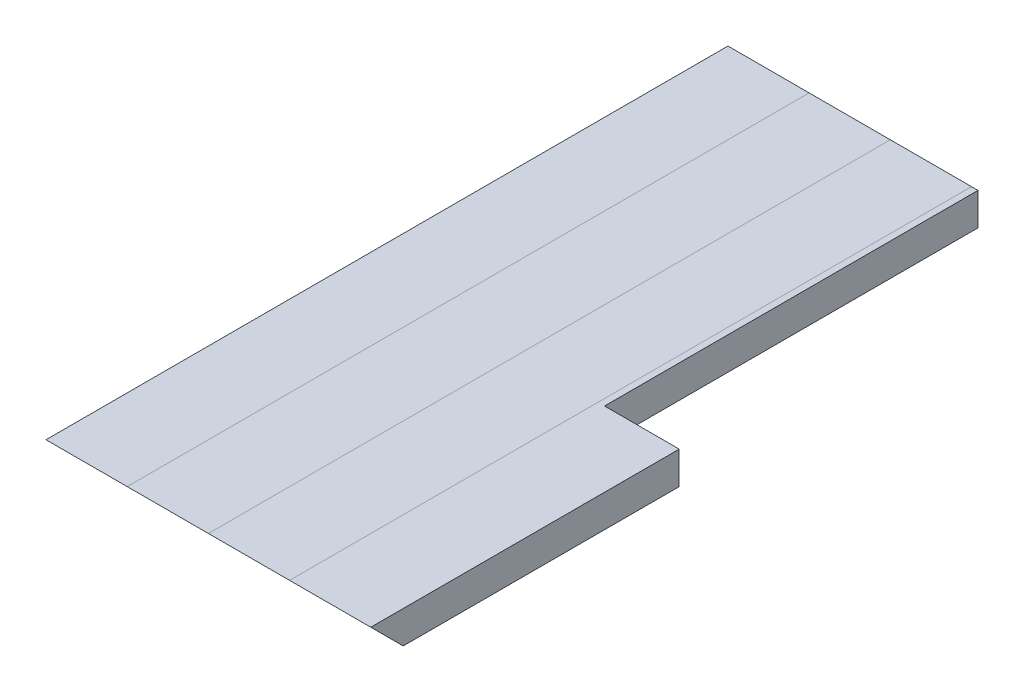
ISO-10303-21;
HEADER;
FILE_DESCRIPTION(('STEP AP214'),'2;1');
FILE_NAME('part.step','',(''),(''),'','','');
FILE_SCHEMA(('AUTOMOTIVE_DESIGN { 1 0 10303 214 1 1 1 1 }'));
ENDSEC;
DATA;
#1=APPLICATION_CONTEXT('core data for automotive mechanical design processes');
#2=APPLICATION_PROTOCOL_DEFINITION('international standard','automotive_design',2000,#1);
#3=PRODUCT_CONTEXT('',#1,'mechanical');
#4=PRODUCT('Part','Part','',(#3));
#5=PRODUCT_RELATED_PRODUCT_CATEGORY('part','',(#4));
#6=PRODUCT_DEFINITION_FORMATION('','',#4);
#7=PRODUCT_DEFINITION_CONTEXT('part definition',#1,'design');
#8=PRODUCT_DEFINITION('design','',#6,#7);
#9=PRODUCT_DEFINITION_SHAPE('','',#8);
#10=(LENGTH_UNIT() NAMED_UNIT(*) SI_UNIT(.MILLI.,.METRE.));
#11=(NAMED_UNIT(*) PLANE_ANGLE_UNIT() SI_UNIT($,.RADIAN.));
#12=(NAMED_UNIT(*) SI_UNIT($,.STERADIAN.) SOLID_ANGLE_UNIT());
#13=UNCERTAINTY_MEASURE_WITH_UNIT(LENGTH_MEASURE(1.E-05),#10,'distance_accuracy_value','');
#14=(GEOMETRIC_REPRESENTATION_CONTEXT(3) GLOBAL_UNCERTAINTY_ASSIGNED_CONTEXT((#13)) GLOBAL_UNIT_ASSIGNED_CONTEXT((#10,
#11,#12)) REPRESENTATION_CONTEXT('',''));
#15=CARTESIAN_POINT('',(0.,0.,0.));
#16=DIRECTION('',(0.,0.,1.));
#17=DIRECTION('',(1.,0.,0.));
#18=AXIS2_PLACEMENT_3D('',#15,#16,#17);
#19=CARTESIAN_POINT('',(0.,0.,0.));
#20=DIRECTION('',(0.,1.,0.));
#21=DIRECTION('',(0.,0.,1.));
#22=AXIS2_PLACEMENT_3D('',#19,#20,#21);
#23=PLANE('',#22);
#24=DIRECTION('',(0.,0.,1.));
#25=VECTOR('',#24,1.);
#26=CARTESIAN_POINT('',(-12.5,0.,-105.));
#27=LINE('',#26,#25);
#28=CARTESIAN_POINT('',(-12.5,0.,-105.));
#29=VERTEX_POINT('',#28);
#30=CARTESIAN_POINT('',(-12.5,0.,95.));
#31=VERTEX_POINT('',#30);
#32=EDGE_CURVE('P0_E81',#29,#31,#27,.T.);
#33=ORIENTED_EDGE('',*,*,#32,.F.);
#34=DIRECTION('',(-1.,0.,0.));
#35=VECTOR('',#34,1.);
#36=CARTESIAN_POINT('',(12.5,0.,-105.));
#37=LINE('',#36,#35);
#38=CARTESIAN_POINT('',(12.5,0.,-105.));
#39=VERTEX_POINT('',#38);
#40=EDGE_CURVE('P0_E55',#39,#29,#37,.T.);
#41=ORIENTED_EDGE('',*,*,#40,.F.);
#42=DIRECTION('',(0.,0.,-1.));
#43=VECTOR('',#42,1.);
#44=CARTESIAN_POINT('',(12.5,0.,105.));
#45=LINE('',#44,#43);
#46=CARTESIAN_POINT('',(12.5,0.,95.));
#47=VERTEX_POINT('',#46);
#48=EDGE_CURVE('P0_E67',#47,#39,#45,.T.);
#49=ORIENTED_EDGE('',*,*,#48,.F.);
#50=DIRECTION('',(1.,0.,0.));
#51=VECTOR('',#50,1.);
#52=CARTESIAN_POINT('',(-12.5,0.,95.));
#53=LINE('',#52,#51);
#54=EDGE_CURVE('P0_E20',#47,#31,#53,.F.);
#55=ORIENTED_EDGE('',*,*,#54,.T.);
#56=EDGE_LOOP('',(#33,#41,#49,#55));
#57=FACE_BOUND('',#56,.T.);
#58=ADVANCED_FACE('P0_F17',(#57),#23,.F.);
#59=CARTESIAN_POINT('',(-12.5,0.,95.));
#60=DIRECTION('',(0.,0.707106781186548,-0.707106781186548));
#61=DIRECTION('',(0.,0.707106781186548,0.707106781186548));
#62=AXIS2_PLACEMENT_3D('',#59,#60,#61);
#63=PLANE('',#62);
#64=DIRECTION('',(1.,0.,0.));
#65=VECTOR('',#64,1.);
#66=CARTESIAN_POINT('',(0.,10.,105.));
#67=LINE('',#66,#65);
#68=CARTESIAN_POINT('',(-12.5,9.99999999999999,105.));
#69=VERTEX_POINT('',#68);
#70=CARTESIAN_POINT('',(12.5,10.,105.));
#71=VERTEX_POINT('',#70);
#72=EDGE_CURVE('P0_E83',#69,#71,#67,.T.);
#73=ORIENTED_EDGE('',*,*,#72,.F.);
#74=DIRECTION('',(0.,0.707106781186548,0.707106781186547));
#75=VECTOR('',#74,1.);
#76=CARTESIAN_POINT('',(-12.5,0.,95.));
#77=LINE('',#76,#75);
#78=EDGE_CURVE('P0_E65',#31,#69,#77,.T.);
#79=ORIENTED_EDGE('',*,*,#78,.F.);
#80=ORIENTED_EDGE('',*,*,#54,.F.);
#81=DIRECTION('',(0.,-0.707106781186548,-0.707106781186547));
#82=VECTOR('',#81,1.);
#83=CARTESIAN_POINT('',(12.5,10.,105.));
#84=LINE('',#83,#82);
#85=EDGE_CURVE('P0_E62',#71,#47,#84,.T.);
#86=ORIENTED_EDGE('',*,*,#85,.F.);
#87=EDGE_LOOP('',(#73,#79,#80,#86));
#88=FACE_BOUND('',#87,.T.);
#89=ADVANCED_FACE('P0_F60',(#88),#63,.F.);
#90=CARTESIAN_POINT('',(12.5,0.,105.));
#91=DIRECTION('',(1.,0.,0.));
#92=DIRECTION('',(0.,0.,-1.));
#93=AXIS2_PLACEMENT_3D('',#90,#91,#92);
#94=PLANE('',#93);
#95=DIRECTION('',(0.,1.,0.));
#96=VECTOR('',#95,1.);
#97=CARTESIAN_POINT('',(12.5,0.,-105.));
#98=LINE('',#97,#96);
#99=CARTESIAN_POINT('',(12.5,10.,-105.));
#100=VERTEX_POINT('',#99);
#101=EDGE_CURVE('P0_E77',#100,#39,#98,.F.);
#102=ORIENTED_EDGE('',*,*,#101,.F.);
#103=DIRECTION('',(0.,0.,1.));
#104=VECTOR('',#103,1.);
#105=CARTESIAN_POINT('',(12.5,10.,0.));
#106=LINE('',#105,#104);
#107=EDGE_CURVE('P0_E73',#71,#100,#106,.F.);
#108=ORIENTED_EDGE('',*,*,#107,.F.);
#109=ORIENTED_EDGE('',*,*,#85,.T.);
#110=ORIENTED_EDGE('',*,*,#48,.T.);
#111=EDGE_LOOP('',(#102,#108,#109,#110));
#112=FACE_BOUND('',#111,.T.);
#113=ADVANCED_FACE('P0_F71',(#112),#94,.T.);
#114=CARTESIAN_POINT('',(12.5,0.,-105.));
#115=DIRECTION('',(0.,0.,-1.));
#116=DIRECTION('',(-1.,0.,0.));
#117=AXIS2_PLACEMENT_3D('',#114,#115,#116);
#118=PLANE('',#117);
#119=DIRECTION('',(1.,0.,0.));
#120=VECTOR('',#119,1.);
#121=CARTESIAN_POINT('',(0.,10.,-105.));
#122=LINE('',#121,#120);
#123=CARTESIAN_POINT('',(-12.5,10.,-105.));
#124=VERTEX_POINT('',#123);
#125=EDGE_CURVE('P0_E26',#100,#124,#122,.F.);
#126=ORIENTED_EDGE('',*,*,#125,.F.);
#127=ORIENTED_EDGE('',*,*,#101,.T.);
#128=ORIENTED_EDGE('',*,*,#40,.T.);
#129=DIRECTION('',(0.,1.,0.));
#130=VECTOR('',#129,1.);
#131=CARTESIAN_POINT('',(-12.5,0.,-105.));
#132=LINE('',#131,#130);
#133=EDGE_CURVE('P0_E35',#124,#29,#132,.F.);
#134=ORIENTED_EDGE('',*,*,#133,.F.);
#135=EDGE_LOOP('',(#126,#127,#128,#134));
#136=FACE_BOUND('',#135,.T.);
#137=ADVANCED_FACE('P0_F89',(#136),#118,.T.);
#138=CARTESIAN_POINT('',(-12.5,0.,-105.));
#139=DIRECTION('',(-1.,0.,0.));
#140=DIRECTION('',(0.,0.,1.));
#141=AXIS2_PLACEMENT_3D('',#138,#139,#140);
#142=PLANE('',#141);
#143=ORIENTED_EDGE('',*,*,#133,.T.);
#144=ORIENTED_EDGE('',*,*,#32,.T.);
#145=ORIENTED_EDGE('',*,*,#78,.T.);
#146=DIRECTION('',(0.,0.,1.));
#147=VECTOR('',#146,1.);
#148=CARTESIAN_POINT('',(-12.5,10.,0.));
#149=LINE('',#148,#147);
#150=EDGE_CURVE('P0_E11',#124,#69,#149,.T.);
#151=ORIENTED_EDGE('',*,*,#150,.F.);
#152=EDGE_LOOP('',(#143,#144,#145,#151));
#153=FACE_BOUND('',#152,.T.);
#154=ADVANCED_FACE('P0_F91',(#153),#142,.T.);
#155=CARTESIAN_POINT('',(0.,10.,0.));
#156=DIRECTION('',(0.,1.,0.));
#157=DIRECTION('',(0.,0.,1.));
#158=AXIS2_PLACEMENT_3D('',#155,#156,#157);
#159=PLANE('',#158);
#160=ORIENTED_EDGE('',*,*,#125,.T.);
#161=ORIENTED_EDGE('',*,*,#150,.T.);
#162=ORIENTED_EDGE('',*,*,#72,.T.);
#163=ORIENTED_EDGE('',*,*,#107,.T.);
#164=EDGE_LOOP('',(#160,#161,#162,#163));
#165=FACE_BOUND('',#164,.T.);
#166=ADVANCED_FACE('P0_F88',(#165),#159,.T.);
#167=CLOSED_SHELL('',(#58,#89,#113,#137,#154,#166));
#168=MANIFOLD_SOLID_BREP('P0_B1',#167);
#169=CARTESIAN_POINT('',(25.,0.,0.));
#170=DIRECTION('',(0.,1.,0.));
#171=DIRECTION('',(0.,0.,1.));
#172=AXIS2_PLACEMENT_3D('',#169,#170,#171);
#173=PLANE('',#172);
#174=DIRECTION('',(0.,0.,1.));
#175=VECTOR('',#174,1.);
#176=CARTESIAN_POINT('',(12.5,0.,-105.));
#177=LINE('',#176,#175);
#178=CARTESIAN_POINT('',(12.5,0.,-105.));
#179=VERTEX_POINT('',#178);
#180=CARTESIAN_POINT('',(12.5,0.,95.));
#181=VERTEX_POINT('',#180);
#182=EDGE_CURVE('P1_E81',#179,#181,#177,.T.);
#183=ORIENTED_EDGE('',*,*,#182,.F.);
#184=DIRECTION('',(-1.,0.,0.));
#185=VECTOR('',#184,1.);
#186=CARTESIAN_POINT('',(37.5,0.,-105.));
#187=LINE('',#186,#185);
#188=CARTESIAN_POINT('',(37.5,0.,-105.));
#189=VERTEX_POINT('',#188);
#190=EDGE_CURVE('P1_E55',#189,#179,#187,.T.);
#191=ORIENTED_EDGE('',*,*,#190,.F.);
#192=DIRECTION('',(0.,0.,-1.));
#193=VECTOR('',#192,1.);
#194=CARTESIAN_POINT('',(37.5,0.,105.));
#195=LINE('',#194,#193);
#196=CARTESIAN_POINT('',(37.5,0.,95.));
#197=VERTEX_POINT('',#196);
#198=EDGE_CURVE('P1_E67',#197,#189,#195,.T.);
#199=ORIENTED_EDGE('',*,*,#198,.F.);
#200=DIRECTION('',(1.,0.,0.));
#201=VECTOR('',#200,1.);
#202=CARTESIAN_POINT('',(-12.5,0.,95.));
#203=LINE('',#202,#201);
#204=EDGE_CURVE('P1_E20',#197,#181,#203,.F.);
#205=ORIENTED_EDGE('',*,*,#204,.T.);
#206=EDGE_LOOP('',(#183,#191,#199,#205));
#207=FACE_BOUND('',#206,.T.);
#208=ADVANCED_FACE('P1_F17',(#207),#173,.F.);
#209=CARTESIAN_POINT('',(-12.5,0.,95.));
#210=DIRECTION('',(0.,0.707106781186548,-0.707106781186548));
#211=DIRECTION('',(0.,0.707106781186548,0.707106781186548));
#212=AXIS2_PLACEMENT_3D('',#209,#210,#211);
#213=PLANE('',#212);
#214=ORIENTED_EDGE('',*,*,#204,.F.);
#215=DIRECTION('',(0.,-0.707106781186548,-0.707106781186547));
#216=VECTOR('',#215,1.);
#217=CARTESIAN_POINT('',(37.5,10.,105.));
#218=LINE('',#217,#216);
#219=CARTESIAN_POINT('',(37.5,10.,105.));
#220=VERTEX_POINT('',#219);
#221=EDGE_CURVE('P1_E62',#220,#197,#218,.T.);
#222=ORIENTED_EDGE('',*,*,#221,.F.);
#223=DIRECTION('',(1.,0.,0.));
#224=VECTOR('',#223,1.);
#225=CARTESIAN_POINT('',(25.,10.,105.));
#226=LINE('',#225,#224);
#227=CARTESIAN_POINT('',(12.5,10.,105.));
#228=VERTEX_POINT('',#227);
#229=EDGE_CURVE('P1_E83',#228,#220,#226,.T.);
#230=ORIENTED_EDGE('',*,*,#229,.F.);
#231=DIRECTION('',(0.,0.707106781186548,0.707106781186547));
#232=VECTOR('',#231,1.);
#233=CARTESIAN_POINT('',(12.5,0.,95.));
#234=LINE('',#233,#232);
#235=EDGE_CURVE('P1_E65',#181,#228,#234,.T.);
#236=ORIENTED_EDGE('',*,*,#235,.F.);
#237=EDGE_LOOP('',(#214,#222,#230,#236));
#238=FACE_BOUND('',#237,.T.);
#239=ADVANCED_FACE('P1_F60',(#238),#213,.F.);
#240=CARTESIAN_POINT('',(37.5,0.,105.));
#241=DIRECTION('',(1.,0.,0.));
#242=DIRECTION('',(0.,0.,-1.));
#243=AXIS2_PLACEMENT_3D('',#240,#241,#242);
#244=PLANE('',#243);
#245=DIRECTION('',(0.,1.,0.));
#246=VECTOR('',#245,1.);
#247=CARTESIAN_POINT('',(37.5,0.,-105.));
#248=LINE('',#247,#246);
#249=CARTESIAN_POINT('',(37.5,10.,-105.));
#250=VERTEX_POINT('',#249);
#251=EDGE_CURVE('P1_E77',#250,#189,#248,.F.);
#252=ORIENTED_EDGE('',*,*,#251,.F.);
#253=DIRECTION('',(0.,0.,1.));
#254=VECTOR('',#253,1.);
#255=CARTESIAN_POINT('',(37.5,10.,0.));
#256=LINE('',#255,#254);
#257=EDGE_CURVE('P1_E73',#220,#250,#256,.F.);
#258=ORIENTED_EDGE('',*,*,#257,.F.);
#259=ORIENTED_EDGE('',*,*,#221,.T.);
#260=ORIENTED_EDGE('',*,*,#198,.T.);
#261=EDGE_LOOP('',(#252,#258,#259,#260));
#262=FACE_BOUND('',#261,.T.);
#263=ADVANCED_FACE('P1_F71',(#262),#244,.T.);
#264=CARTESIAN_POINT('',(37.5,0.,-105.));
#265=DIRECTION('',(0.,0.,-1.));
#266=DIRECTION('',(-1.,0.,0.));
#267=AXIS2_PLACEMENT_3D('',#264,#265,#266);
#268=PLANE('',#267);
#269=DIRECTION('',(1.,0.,0.));
#270=VECTOR('',#269,1.);
#271=CARTESIAN_POINT('',(25.,10.,-105.));
#272=LINE('',#271,#270);
#273=CARTESIAN_POINT('',(12.5,10.,-105.));
#274=VERTEX_POINT('',#273);
#275=EDGE_CURVE('P1_E26',#250,#274,#272,.F.);
#276=ORIENTED_EDGE('',*,*,#275,.F.);
#277=ORIENTED_EDGE('',*,*,#251,.T.);
#278=ORIENTED_EDGE('',*,*,#190,.T.);
#279=DIRECTION('',(0.,1.,0.));
#280=VECTOR('',#279,1.);
#281=CARTESIAN_POINT('',(12.5,0.,-105.));
#282=LINE('',#281,#280);
#283=EDGE_CURVE('P1_E35',#274,#179,#282,.F.);
#284=ORIENTED_EDGE('',*,*,#283,.F.);
#285=EDGE_LOOP('',(#276,#277,#278,#284));
#286=FACE_BOUND('',#285,.T.);
#287=ADVANCED_FACE('P1_F89',(#286),#268,.T.);
#288=CARTESIAN_POINT('',(12.5,0.,-105.));
#289=DIRECTION('',(-1.,0.,0.));
#290=DIRECTION('',(0.,0.,1.));
#291=AXIS2_PLACEMENT_3D('',#288,#289,#290);
#292=PLANE('',#291);
#293=ORIENTED_EDGE('',*,*,#283,.T.);
#294=ORIENTED_EDGE('',*,*,#182,.T.);
#295=ORIENTED_EDGE('',*,*,#235,.T.);
#296=DIRECTION('',(0.,0.,1.));
#297=VECTOR('',#296,1.);
#298=CARTESIAN_POINT('',(12.5,10.,0.));
#299=LINE('',#298,#297);
#300=EDGE_CURVE('P1_E11',#274,#228,#299,.T.);
#301=ORIENTED_EDGE('',*,*,#300,.F.);
#302=EDGE_LOOP('',(#293,#294,#295,#301));
#303=FACE_BOUND('',#302,.T.);
#304=ADVANCED_FACE('P1_F91',(#303),#292,.T.);
#305=CARTESIAN_POINT('',(25.,10.,0.));
#306=DIRECTION('',(0.,1.,0.));
#307=DIRECTION('',(0.,0.,1.));
#308=AXIS2_PLACEMENT_3D('',#305,#306,#307);
#309=PLANE('',#308);
#310=ORIENTED_EDGE('',*,*,#275,.T.);
#311=ORIENTED_EDGE('',*,*,#300,.T.);
#312=ORIENTED_EDGE('',*,*,#229,.T.);
#313=ORIENTED_EDGE('',*,*,#257,.T.);
#314=EDGE_LOOP('',(#310,#311,#312,#313));
#315=FACE_BOUND('',#314,.T.);
#316=ADVANCED_FACE('P1_F88',(#315),#309,.T.);
#317=CLOSED_SHELL('',(#208,#239,#263,#287,#304,#316));
#318=MANIFOLD_SOLID_BREP('P1_B1',#317);
#319=CARTESIAN_POINT('',(75.,0.,0.));
#320=DIRECTION('',(0.,1.,0.));
#321=DIRECTION('',(0.,0.,1.));
#322=AXIS2_PLACEMENT_3D('',#319,#320,#321);
#323=PLANE('',#322);
#324=DIRECTION('',(1.,0.,0.));
#325=VECTOR('',#324,1.);
#326=CARTESIAN_POINT('',(64.5,0.,10.));
#327=LINE('',#326,#325);
#328=CARTESIAN_POINT('',(64.5,0.,10.));
#329=VERTEX_POINT('',#328);
#330=CARTESIAN_POINT('',(87.5,0.,10.));
#331=VERTEX_POINT('',#330);
#332=EDGE_CURVE('P2_E103',#329,#331,#327,.T.);
#333=ORIENTED_EDGE('',*,*,#332,.T.);
#334=DIRECTION('',(0.,0.,-1.));
#335=VECTOR('',#334,1.);
#336=CARTESIAN_POINT('',(87.5,0.,105.));
#337=LINE('',#336,#335);
#338=CARTESIAN_POINT('',(87.5000000000001,0.,95.));
#339=VERTEX_POINT('',#338);
#340=EDGE_CURVE('P2_E99',#339,#331,#337,.T.);
#341=ORIENTED_EDGE('',*,*,#340,.F.);
#342=DIRECTION('',(1.,0.,0.));
#343=VECTOR('',#342,1.);
#344=CARTESIAN_POINT('',(-12.5,0.,95.));
#345=LINE('',#344,#343);
#346=CARTESIAN_POINT('',(62.5,0.,95.));
#347=VERTEX_POINT('',#346);
#348=EDGE_CURVE('P2_E92',#339,#347,#345,.F.);
#349=ORIENTED_EDGE('',*,*,#348,.T.);
#350=DIRECTION('',(0.,0.,1.));
#351=VECTOR('',#350,1.);
#352=CARTESIAN_POINT('',(62.5,0.,-105.));
#353=LINE('',#352,#351);
#354=CARTESIAN_POINT('',(62.5,0.,-105.));
#355=VERTEX_POINT('',#354);
#356=EDGE_CURVE('P2_E81',#355,#347,#353,.T.);
#357=ORIENTED_EDGE('',*,*,#356,.F.);
#358=DIRECTION('',(-1.,0.,0.));
#359=VECTOR('',#358,1.);
#360=CARTESIAN_POINT('',(87.5,0.,-105.));
#361=LINE('',#360,#359);
#362=CARTESIAN_POINT('',(64.5,0.,-105.));
#363=VERTEX_POINT('',#362);
#364=EDGE_CURVE('P2_E67',#363,#355,#361,.T.);
#365=ORIENTED_EDGE('',*,*,#364,.F.);
#366=DIRECTION('',(0.,0.,1.));
#367=VECTOR('',#366,1.);
#368=CARTESIAN_POINT('',(64.5,0.,-105.));
#369=LINE('',#368,#367);
#370=EDGE_CURVE('P2_E20',#363,#329,#369,.T.);
#371=ORIENTED_EDGE('',*,*,#370,.T.);
#372=EDGE_LOOP('',(#333,#341,#349,#357,#365,#371));
#373=FACE_BOUND('',#372,.T.);
#374=ADVANCED_FACE('P2_F17',(#373),#323,.F.);
#375=CARTESIAN_POINT('',(64.5,0.,-105.));
#376=DIRECTION('',(-1.,0.,0.));
#377=DIRECTION('',(0.,0.,1.));
#378=AXIS2_PLACEMENT_3D('',#375,#376,#377);
#379=PLANE('',#378);
#380=DIRECTION('',(0.,1.,0.));
#381=VECTOR('',#380,1.);
#382=CARTESIAN_POINT('',(64.5,0.,-105.));
#383=LINE('',#382,#381);
#384=CARTESIAN_POINT('',(64.5,10.,-105.));
#385=VERTEX_POINT('',#384);
#386=EDGE_CURVE('P2_E73',#385,#363,#383,.F.);
#387=ORIENTED_EDGE('',*,*,#386,.F.);
#388=DIRECTION('',(0.,0.,1.));
#389=VECTOR('',#388,1.);
#390=CARTESIAN_POINT('',(64.5,10.,0.));
#391=LINE('',#390,#389);
#392=CARTESIAN_POINT('',(64.5,10.,10.));
#393=VERTEX_POINT('',#392);
#394=EDGE_CURVE('P2_E105',#393,#385,#391,.F.);
#395=ORIENTED_EDGE('',*,*,#394,.F.);
#396=DIRECTION('',(0.,1.,0.));
#397=VECTOR('',#396,1.);
#398=CARTESIAN_POINT('',(64.5,0.,10.));
#399=LINE('',#398,#397);
#400=EDGE_CURVE('P2_E76',#393,#329,#399,.F.);
#401=ORIENTED_EDGE('',*,*,#400,.T.);
#402=ORIENTED_EDGE('',*,*,#370,.F.);
#403=EDGE_LOOP('',(#387,#395,#401,#402));
#404=FACE_BOUND('',#403,.T.);
#405=ADVANCED_FACE('P2_F72',(#404),#379,.F.);
#406=CARTESIAN_POINT('',(87.5,0.,-105.));
#407=DIRECTION('',(0.,0.,-1.));
#408=DIRECTION('',(-1.,0.,0.));
#409=AXIS2_PLACEMENT_3D('',#406,#407,#408);
#410=PLANE('',#409);
#411=DIRECTION('',(0.,1.,0.));
#412=VECTOR('',#411,1.);
#413=CARTESIAN_POINT('',(62.5,0.,-105.));
#414=LINE('',#413,#412);
#415=CARTESIAN_POINT('',(62.5,10.,-105.));
#416=VERTEX_POINT('',#415);
#417=EDGE_CURVE('P2_E83',#416,#355,#414,.F.);
#418=ORIENTED_EDGE('',*,*,#417,.F.);
#419=DIRECTION('',(1.,0.,0.));
#420=VECTOR('',#419,1.);
#421=CARTESIAN_POINT('',(75.,10.,-105.));
#422=LINE('',#421,#420);
#423=EDGE_CURVE('P2_E87',#385,#416,#422,.F.);
#424=ORIENTED_EDGE('',*,*,#423,.F.);
#425=ORIENTED_EDGE('',*,*,#386,.T.);
#426=ORIENTED_EDGE('',*,*,#364,.T.);
#427=EDGE_LOOP('',(#418,#424,#425,#426));
#428=FACE_BOUND('',#427,.T.);
#429=ADVANCED_FACE('P2_F85',(#428),#410,.T.);
#430=CARTESIAN_POINT('',(62.5,0.,-105.));
#431=DIRECTION('',(-1.,0.,0.));
#432=DIRECTION('',(0.,0.,1.));
#433=AXIS2_PLACEMENT_3D('',#430,#431,#432);
#434=PLANE('',#433);
#435=ORIENTED_EDGE('',*,*,#417,.T.);
#436=ORIENTED_EDGE('',*,*,#356,.T.);
#437=DIRECTION('',(0.,0.707106781186548,0.707106781186548));
#438=VECTOR('',#437,1.);
#439=CARTESIAN_POINT('',(62.5,0.,95.));
#440=LINE('',#439,#438);
#441=CARTESIAN_POINT('',(62.5,10.,105.));
#442=VERTEX_POINT('',#441);
#443=EDGE_CURVE('P2_E94',#347,#442,#440,.T.);
#444=ORIENTED_EDGE('',*,*,#443,.T.);
#445=DIRECTION('',(0.,0.,1.));
#446=VECTOR('',#445,1.);
#447=CARTESIAN_POINT('',(62.5,10.,0.));
#448=LINE('',#447,#446);
#449=EDGE_CURVE('P2_E108',#416,#442,#448,.T.);
#450=ORIENTED_EDGE('',*,*,#449,.F.);
#451=EDGE_LOOP('',(#435,#436,#444,#450));
#452=FACE_BOUND('',#451,.T.);
#453=ADVANCED_FACE('P2_F137',(#452),#434,.T.);
#454=CARTESIAN_POINT('',(-12.5,0.,95.));
#455=DIRECTION('',(0.,0.707106781186548,-0.707106781186548));
#456=DIRECTION('',(0.,0.707106781186548,0.707106781186548));
#457=AXIS2_PLACEMENT_3D('',#454,#455,#456);
#458=PLANE('',#457);
#459=DIRECTION('',(1.,0.,0.));
#460=VECTOR('',#459,1.);
#461=CARTESIAN_POINT('',(75.,10.,105.));
#462=LINE('',#461,#460);
#463=CARTESIAN_POINT('',(87.5000000000001,10.,105.));
#464=VERTEX_POINT('',#463);
#465=EDGE_CURVE('P2_E111',#442,#464,#462,.T.);
#466=ORIENTED_EDGE('',*,*,#465,.F.);
#467=ORIENTED_EDGE('',*,*,#443,.F.);
#468=ORIENTED_EDGE('',*,*,#348,.F.);
#469=DIRECTION('',(0.,-0.707106781186548,-0.707106781186547));
#470=VECTOR('',#469,1.);
#471=CARTESIAN_POINT('',(87.5,10.,105.));
#472=LINE('',#471,#470);
#473=EDGE_CURVE('P2_E96',#464,#339,#472,.T.);
#474=ORIENTED_EDGE('',*,*,#473,.F.);
#475=EDGE_LOOP('',(#466,#467,#468,#474));
#476=FACE_BOUND('',#475,.T.);
#477=ADVANCED_FACE('P2_F121',(#476),#458,.F.);
#478=CARTESIAN_POINT('',(87.5,0.,105.));
#479=DIRECTION('',(1.,0.,0.));
#480=DIRECTION('',(0.,0.,-1.));
#481=AXIS2_PLACEMENT_3D('',#478,#479,#480);
#482=PLANE('',#481);
#483=ORIENTED_EDGE('',*,*,#473,.T.);
#484=ORIENTED_EDGE('',*,*,#340,.T.);
#485=DIRECTION('',(0.,1.,0.));
#486=VECTOR('',#485,1.);
#487=CARTESIAN_POINT('',(87.5,0.,10.));
#488=LINE('',#487,#486);
#489=CARTESIAN_POINT('',(87.5,10.,10.));
#490=VERTEX_POINT('',#489);
#491=EDGE_CURVE('P2_E35',#331,#490,#488,.T.);
#492=ORIENTED_EDGE('',*,*,#491,.T.);
#493=DIRECTION('',(0.,0.,1.));
#494=VECTOR('',#493,1.);
#495=CARTESIAN_POINT('',(87.5,10.,0.));
#496=LINE('',#495,#494);
#497=EDGE_CURVE('P2_E26',#464,#490,#496,.F.);
#498=ORIENTED_EDGE('',*,*,#497,.F.);
#499=EDGE_LOOP('',(#483,#484,#492,#498));
#500=FACE_BOUND('',#499,.T.);
#501=ADVANCED_FACE('P2_F118',(#500),#482,.T.);
#502=CARTESIAN_POINT('',(64.5,0.,10.));
#503=DIRECTION('',(0.,0.,1.));
#504=DIRECTION('',(1.,0.,0.));
#505=AXIS2_PLACEMENT_3D('',#502,#503,#504);
#506=PLANE('',#505);
#507=ORIENTED_EDGE('',*,*,#400,.F.);
#508=DIRECTION('',(1.,0.,0.));
#509=VECTOR('',#508,1.);
#510=CARTESIAN_POINT('',(75.,10.,10.));
#511=LINE('',#510,#509);
#512=EDGE_CURVE('P2_E11',#490,#393,#511,.F.);
#513=ORIENTED_EDGE('',*,*,#512,.F.);
#514=ORIENTED_EDGE('',*,*,#491,.F.);
#515=ORIENTED_EDGE('',*,*,#332,.F.);
#516=EDGE_LOOP('',(#507,#513,#514,#515));
#517=FACE_BOUND('',#516,.T.);
#518=ADVANCED_FACE('P2_F124',(#517),#506,.F.);
#519=CARTESIAN_POINT('',(75.,10.,0.));
#520=DIRECTION('',(0.,1.,0.));
#521=DIRECTION('',(0.,0.,1.));
#522=AXIS2_PLACEMENT_3D('',#519,#520,#521);
#523=PLANE('',#522);
#524=ORIENTED_EDGE('',*,*,#497,.T.);
#525=ORIENTED_EDGE('',*,*,#512,.T.);
#526=ORIENTED_EDGE('',*,*,#394,.T.);
#527=ORIENTED_EDGE('',*,*,#423,.T.);
#528=ORIENTED_EDGE('',*,*,#449,.T.);
#529=ORIENTED_EDGE('',*,*,#465,.T.);
#530=EDGE_LOOP('',(#524,#525,#526,#527,#528,#529));
#531=FACE_BOUND('',#530,.T.);
#532=ADVANCED_FACE('P2_F116',(#531),#523,.T.);
#533=CLOSED_SHELL('',(#374,#405,#429,#453,#477,#501,#518,#532));
#534=MANIFOLD_SOLID_BREP('P2_B1',#533);
#535=CARTESIAN_POINT('',(50.,0.,0.));
#536=DIRECTION('',(0.,1.,0.));
#537=DIRECTION('',(0.,0.,1.));
#538=AXIS2_PLACEMENT_3D('',#535,#536,#537);
#539=PLANE('',#538);
#540=DIRECTION('',(0.,0.,1.));
#541=VECTOR('',#540,1.);
#542=CARTESIAN_POINT('',(37.5,0.,-105.));
#543=LINE('',#542,#541);
#544=CARTESIAN_POINT('',(37.5,0.,-105.));
#545=VERTEX_POINT('',#544);
#546=CARTESIAN_POINT('',(37.5,0.,95.));
#547=VERTEX_POINT('',#546);
#548=EDGE_CURVE('P3_E81',#545,#547,#543,.T.);
#549=ORIENTED_EDGE('',*,*,#548,.F.);
#550=DIRECTION('',(-1.,0.,0.));
#551=VECTOR('',#550,1.);
#552=CARTESIAN_POINT('',(62.5,0.,-105.));
#553=LINE('',#552,#551);
#554=CARTESIAN_POINT('',(62.5,0.,-105.));
#555=VERTEX_POINT('',#554);
#556=EDGE_CURVE('P3_E55',#555,#545,#553,.T.);
#557=ORIENTED_EDGE('',*,*,#556,.F.);
#558=DIRECTION('',(0.,0.,-1.));
#559=VECTOR('',#558,1.);
#560=CARTESIAN_POINT('',(62.5,0.,105.));
#561=LINE('',#560,#559);
#562=CARTESIAN_POINT('',(62.5,0.,95.));
#563=VERTEX_POINT('',#562);
#564=EDGE_CURVE('P3_E67',#563,#555,#561,.T.);
#565=ORIENTED_EDGE('',*,*,#564,.F.);
#566=DIRECTION('',(1.,0.,0.));
#567=VECTOR('',#566,1.);
#568=CARTESIAN_POINT('',(-12.5,0.,95.));
#569=LINE('',#568,#567);
#570=EDGE_CURVE('P3_E20',#563,#547,#569,.F.);
#571=ORIENTED_EDGE('',*,*,#570,.T.);
#572=EDGE_LOOP('',(#549,#557,#565,#571));
#573=FACE_BOUND('',#572,.T.);
#574=ADVANCED_FACE('P3_F17',(#573),#539,.F.);
#575=CARTESIAN_POINT('',(-12.5,0.,95.));
#576=DIRECTION('',(0.,0.707106781186548,-0.707106781186548));
#577=DIRECTION('',(0.,0.707106781186548,0.707106781186548));
#578=AXIS2_PLACEMENT_3D('',#575,#576,#577);
#579=PLANE('',#578);
#580=ORIENTED_EDGE('',*,*,#570,.F.);
#581=DIRECTION('',(0.,-0.707106781186548,-0.707106781186547));
#582=VECTOR('',#581,1.);
#583=CARTESIAN_POINT('',(62.5,10.,105.));
#584=LINE('',#583,#582);
#585=CARTESIAN_POINT('',(62.5,10.,105.));
#586=VERTEX_POINT('',#585);
#587=EDGE_CURVE('P3_E62',#586,#563,#584,.T.);
#588=ORIENTED_EDGE('',*,*,#587,.F.);
#589=DIRECTION('',(1.,0.,0.));
#590=VECTOR('',#589,1.);
#591=CARTESIAN_POINT('',(50.,10.,105.));
#592=LINE('',#591,#590);
#593=CARTESIAN_POINT('',(37.5,10.,105.));
#594=VERTEX_POINT('',#593);
#595=EDGE_CURVE('P3_E83',#594,#586,#592,.T.);
#596=ORIENTED_EDGE('',*,*,#595,.F.);
#597=DIRECTION('',(0.,0.707106781186548,0.707106781186547));
#598=VECTOR('',#597,1.);
#599=CARTESIAN_POINT('',(37.5,0.,95.));
#600=LINE('',#599,#598);
#601=EDGE_CURVE('P3_E65',#547,#594,#600,.T.);
#602=ORIENTED_EDGE('',*,*,#601,.F.);
#603=EDGE_LOOP('',(#580,#588,#596,#602));
#604=FACE_BOUND('',#603,.T.);
#605=ADVANCED_FACE('P3_F60',(#604),#579,.F.);
#606=CARTESIAN_POINT('',(62.5,0.,105.));
#607=DIRECTION('',(1.,0.,0.));
#608=DIRECTION('',(0.,0.,-1.));
#609=AXIS2_PLACEMENT_3D('',#606,#607,#608);
#610=PLANE('',#609);
#611=DIRECTION('',(0.,1.,0.));
#612=VECTOR('',#611,1.);
#613=CARTESIAN_POINT('',(62.5,0.,-105.));
#614=LINE('',#613,#612);
#615=CARTESIAN_POINT('',(62.5,10.,-105.));
#616=VERTEX_POINT('',#615);
#617=EDGE_CURVE('P3_E77',#616,#555,#614,.F.);
#618=ORIENTED_EDGE('',*,*,#617,.F.);
#619=DIRECTION('',(0.,0.,1.));
#620=VECTOR('',#619,1.);
#621=CARTESIAN_POINT('',(62.5,10.,0.));
#622=LINE('',#621,#620);
#623=EDGE_CURVE('P3_E73',#586,#616,#622,.F.);
#624=ORIENTED_EDGE('',*,*,#623,.F.);
#625=ORIENTED_EDGE('',*,*,#587,.T.);
#626=ORIENTED_EDGE('',*,*,#564,.T.);
#627=EDGE_LOOP('',(#618,#624,#625,#626));
#628=FACE_BOUND('',#627,.T.);
#629=ADVANCED_FACE('P3_F71',(#628),#610,.T.);
#630=CARTESIAN_POINT('',(62.5,0.,-105.));
#631=DIRECTION('',(0.,0.,-1.));
#632=DIRECTION('',(-1.,0.,0.));
#633=AXIS2_PLACEMENT_3D('',#630,#631,#632);
#634=PLANE('',#633);
#635=DIRECTION('',(1.,0.,0.));
#636=VECTOR('',#635,1.);
#637=CARTESIAN_POINT('',(50.,10.,-105.));
#638=LINE('',#637,#636);
#639=CARTESIAN_POINT('',(37.5,10.,-105.));
#640=VERTEX_POINT('',#639);
#641=EDGE_CURVE('P3_E26',#616,#640,#638,.F.);
#642=ORIENTED_EDGE('',*,*,#641,.F.);
#643=ORIENTED_EDGE('',*,*,#617,.T.);
#644=ORIENTED_EDGE('',*,*,#556,.T.);
#645=DIRECTION('',(0.,1.,0.));
#646=VECTOR('',#645,1.);
#647=CARTESIAN_POINT('',(37.5,0.,-105.));
#648=LINE('',#647,#646);
#649=EDGE_CURVE('P3_E35',#640,#545,#648,.F.);
#650=ORIENTED_EDGE('',*,*,#649,.F.);
#651=EDGE_LOOP('',(#642,#643,#644,#650));
#652=FACE_BOUND('',#651,.T.);
#653=ADVANCED_FACE('P3_F89',(#652),#634,.T.);
#654=CARTESIAN_POINT('',(37.5,0.,-105.));
#655=DIRECTION('',(-1.,0.,0.));
#656=DIRECTION('',(0.,0.,1.));
#657=AXIS2_PLACEMENT_3D('',#654,#655,#656);
#658=PLANE('',#657);
#659=ORIENTED_EDGE('',*,*,#649,.T.);
#660=ORIENTED_EDGE('',*,*,#548,.T.);
#661=ORIENTED_EDGE('',*,*,#601,.T.);
#662=DIRECTION('',(0.,0.,1.));
#663=VECTOR('',#662,1.);
#664=CARTESIAN_POINT('',(37.5,10.,0.));
#665=LINE('',#664,#663);
#666=EDGE_CURVE('P3_E11',#640,#594,#665,.T.);
#667=ORIENTED_EDGE('',*,*,#666,.F.);
#668=EDGE_LOOP('',(#659,#660,#661,#667));
#669=FACE_BOUND('',#668,.T.);
#670=ADVANCED_FACE('P3_F91',(#669),#658,.T.);
#671=CARTESIAN_POINT('',(50.,10.,0.));
#672=DIRECTION('',(0.,1.,0.));
#673=DIRECTION('',(0.,0.,1.));
#674=AXIS2_PLACEMENT_3D('',#671,#672,#673);
#675=PLANE('',#674);
#676=ORIENTED_EDGE('',*,*,#641,.T.);
#677=ORIENTED_EDGE('',*,*,#666,.T.);
#678=ORIENTED_EDGE('',*,*,#595,.T.);
#679=ORIENTED_EDGE('',*,*,#623,.T.);
#680=EDGE_LOOP('',(#676,#677,#678,#679));
#681=FACE_BOUND('',#680,.T.);
#682=ADVANCED_FACE('P3_F88',(#681),#675,.T.);
#683=CLOSED_SHELL('',(#574,#605,#629,#653,#670,#682));
#684=MANIFOLD_SOLID_BREP('P3_B1',#683);
#685=ADVANCED_BREP_SHAPE_REPRESENTATION('',(#18,#168,#318,#534,#684),#14);
#686=SHAPE_DEFINITION_REPRESENTATION(#9,#685);
ENDSEC;
END-ISO-10303-21;
